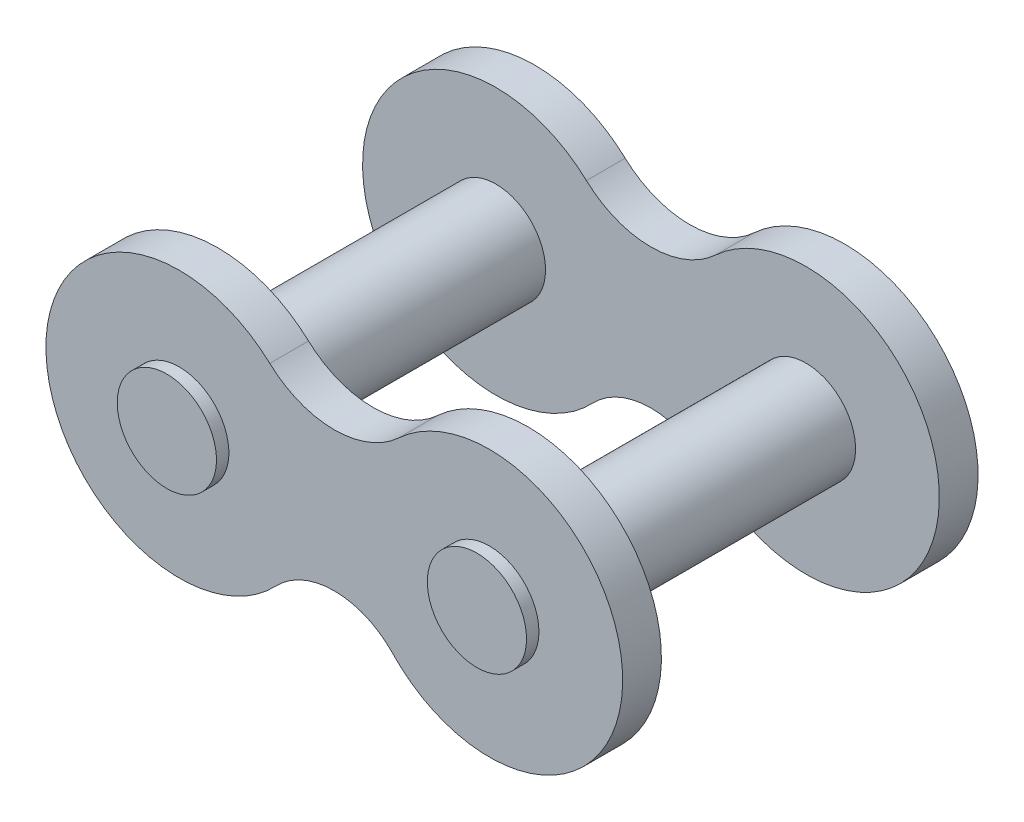
ISO-10303-21;
HEADER;
FILE_DESCRIPTION(('STEP AP214'),'2;1');
FILE_NAME('part.step','',(''),(''),'','','');
FILE_SCHEMA(('AUTOMOTIVE_DESIGN { 1 0 10303 214 1 1 1 1 }'));
ENDSEC;
DATA;
#1=APPLICATION_CONTEXT('core data for automotive mechanical design processes');
#2=APPLICATION_PROTOCOL_DEFINITION('international standard','automotive_design',2000,#1);
#3=PRODUCT_CONTEXT('',#1,'mechanical');
#4=PRODUCT('Part','Part','',(#3));
#5=PRODUCT_RELATED_PRODUCT_CATEGORY('part','',(#4));
#6=PRODUCT_DEFINITION_FORMATION('','',#4);
#7=PRODUCT_DEFINITION_CONTEXT('part definition',#1,'design');
#8=PRODUCT_DEFINITION('design','',#6,#7);
#9=PRODUCT_DEFINITION_SHAPE('','',#8);
#10=(LENGTH_UNIT() NAMED_UNIT(*) SI_UNIT(.MILLI.,.METRE.));
#11=(NAMED_UNIT(*) PLANE_ANGLE_UNIT() SI_UNIT($,.RADIAN.));
#12=(NAMED_UNIT(*) SI_UNIT($,.STERADIAN.) SOLID_ANGLE_UNIT());
#13=UNCERTAINTY_MEASURE_WITH_UNIT(LENGTH_MEASURE(1.E-05),#10,'distance_accuracy_value','');
#14=(GEOMETRIC_REPRESENTATION_CONTEXT(3) GLOBAL_UNCERTAINTY_ASSIGNED_CONTEXT((#13)) GLOBAL_UNIT_ASSIGNED_CONTEXT((#10,
#11,#12)) REPRESENTATION_CONTEXT('',''));
#15=CARTESIAN_POINT('',(0.,0.,0.));
#16=DIRECTION('',(0.,0.,1.));
#17=DIRECTION('',(1.,0.,0.));
#18=AXIS2_PLACEMENT_3D('',#15,#16,#17);
#19=CARTESIAN_POINT('',(3.175,3.4332241798094,1.5875));
#20=DIRECTION('',(0.,0.,1.));
#21=DIRECTION('',(1.,0.,0.));
#22=AXIS2_PLACEMENT_3D('',#19,#20,#21);
#23=PLANE('',#22);
#24=CARTESIAN_POINT('',(-6.35,0.,1.5875));
#25=DIRECTION('',(0.,0.,1.));
#26=DIRECTION('',(1.,0.,0.));
#27=AXIS2_PLACEMENT_3D('',#24,#25,#26);
#28=CIRCLE('',#27,2.032);
#29=CARTESIAN_POINT('',(-4.318,0.,1.5875));
#30=VERTEX_POINT('',#29);
#31=EDGE_CURVE('E169',#30,#30,#28,.T.);
#32=ORIENTED_EDGE('',*,*,#31,.F.);
#33=EDGE_LOOP('',(#32));
#34=FACE_BOUND('',#33,.T.);
#35=CARTESIAN_POINT('',(0.,6.86644835961881,1.5875));
#36=DIRECTION('',(0.,0.,-1.));
#37=DIRECTION('',(1.,0.,0.));
#38=AXIS2_PLACEMENT_3D('',#35,#36,#37);
#39=CIRCLE('',#38,3.89157253782679);
#40=CARTESIAN_POINT('',(2.64221266557984,4.00934334807003,1.5875));
#41=VERTEX_POINT('',#40);
#42=CARTESIAN_POINT('',(-2.64221266557984,4.00934334807003,1.5875));
#43=VERTEX_POINT('',#42);
#44=EDGE_CURVE('E173',#41,#43,#39,.T.);
#45=ORIENTED_EDGE('',*,*,#44,.T.);
#46=CARTESIAN_POINT('',(-6.35,0.,1.5875));
#47=DIRECTION('',(0.,0.,1.));
#48=DIRECTION('',(1.,0.,0.));
#49=AXIS2_PLACEMENT_3D('',#46,#47,#48);
#50=CIRCLE('',#49,5.461);
#51=CARTESIAN_POINT('',(-2.39260343674151,-3.76318129261798,1.5875));
#52=VERTEX_POINT('',#51);
#53=EDGE_CURVE('E86',#43,#52,#50,.T.);
#54=ORIENTED_EDGE('',*,*,#53,.T.);
#55=CARTESIAN_POINT('',(0.,-6.03836406742322,1.5875));
#56=DIRECTION('',(0.,0.,-1.));
#57=DIRECTION('',(-1.,0.,0.));
#58=AXIS2_PLACEMENT_3D('',#55,#56,#57);
#59=CIRCLE('',#58,3.30166743695936);
#60=CARTESIAN_POINT('',(2.39260343674152,-3.76318129261798,1.5875));
#61=VERTEX_POINT('',#60);
#62=EDGE_CURVE('E176',#52,#61,#59,.T.);
#63=ORIENTED_EDGE('',*,*,#62,.T.);
#64=CARTESIAN_POINT('',(6.35,0.,1.5875));
#65=DIRECTION('',(0.,0.,1.));
#66=DIRECTION('',(-1.,0.,0.));
#67=AXIS2_PLACEMENT_3D('',#64,#65,#66);
#68=CIRCLE('',#67,5.461);
#69=EDGE_CURVE('E54',#61,#41,#68,.T.);
#70=ORIENTED_EDGE('',*,*,#69,.T.);
#71=EDGE_LOOP('',(#45,#54,#63,#70));
#72=FACE_BOUND('',#71,.T.);
#73=CARTESIAN_POINT('',(6.35,0.,1.5875));
#74=DIRECTION('',(0.,0.,1.));
#75=DIRECTION('',(-1.,0.,0.));
#76=AXIS2_PLACEMENT_3D('',#73,#74,#75);
#77=CIRCLE('',#76,2.032);
#78=CARTESIAN_POINT('',(4.318,0.,1.5875));
#79=VERTEX_POINT('',#78);
#80=EDGE_CURVE('E166',#79,#79,#77,.T.);
#81=ORIENTED_EDGE('',*,*,#80,.F.);
#82=EDGE_LOOP('',(#81));
#83=FACE_BOUND('',#82,.T.);
#84=ADVANCED_FACE('F37',(#34,#72,#83),#23,.T.);
#85=CARTESIAN_POINT('',(3.175,3.4332241798094,0.));
#86=DIRECTION('',(0.,0.,1.));
#87=DIRECTION('',(1.,0.,0.));
#88=AXIS2_PLACEMENT_3D('',#85,#86,#87);
#89=PLANE('',#88);
#90=CARTESIAN_POINT('',(0.,6.86644835961881,0.));
#91=DIRECTION('',(0.,0.,-1.));
#92=DIRECTION('',(1.,0.,0.));
#93=AXIS2_PLACEMENT_3D('',#90,#91,#92);
#94=CIRCLE('',#93,3.89157253782679);
#95=CARTESIAN_POINT('',(2.64221266557984,4.00934334807003,0.));
#96=VERTEX_POINT('',#95);
#97=CARTESIAN_POINT('',(-2.64221266557984,4.00934334807003,0.));
#98=VERTEX_POINT('',#97);
#99=EDGE_CURVE('E172',#96,#98,#94,.T.);
#100=ORIENTED_EDGE('',*,*,#99,.F.);
#101=CARTESIAN_POINT('',(6.35,0.,0.));
#102=DIRECTION('',(0.,0.,1.));
#103=DIRECTION('',(-1.,0.,0.));
#104=AXIS2_PLACEMENT_3D('',#101,#102,#103);
#105=CIRCLE('',#104,5.461);
#106=CARTESIAN_POINT('',(2.39260343674152,-3.76318129261798,0.));
#107=VERTEX_POINT('',#106);
#108=EDGE_CURVE('E78',#107,#96,#105,.T.);
#109=ORIENTED_EDGE('',*,*,#108,.F.);
#110=CARTESIAN_POINT('',(0.,-6.03836406742322,0.));
#111=DIRECTION('',(0.,0.,-1.));
#112=DIRECTION('',(-1.,0.,0.));
#113=AXIS2_PLACEMENT_3D('',#110,#111,#112);
#114=CIRCLE('',#113,3.30166743695936);
#115=CARTESIAN_POINT('',(-2.39260343674151,-3.76318129261798,0.));
#116=VERTEX_POINT('',#115);
#117=EDGE_CURVE('E72',#116,#107,#114,.T.);
#118=ORIENTED_EDGE('',*,*,#117,.F.);
#119=CARTESIAN_POINT('',(-6.35,0.,0.));
#120=DIRECTION('',(0.,0.,1.));
#121=DIRECTION('',(1.,0.,0.));
#122=AXIS2_PLACEMENT_3D('',#119,#120,#121);
#123=CIRCLE('',#122,5.461);
#124=EDGE_CURVE('E182',#98,#116,#123,.T.);
#125=ORIENTED_EDGE('',*,*,#124,.F.);
#126=EDGE_LOOP('',(#100,#109,#118,#125));
#127=FACE_BOUND('',#126,.T.);
#128=CARTESIAN_POINT('',(-6.35,0.,0.));
#129=DIRECTION('',(0.,0.,1.));
#130=DIRECTION('',(1.,0.,0.));
#131=AXIS2_PLACEMENT_3D('',#128,#129,#130);
#132=CIRCLE('',#131,2.032);
#133=CARTESIAN_POINT('',(-4.318,0.,0.));
#134=VERTEX_POINT('',#133);
#135=EDGE_CURVE('E163',#134,#134,#132,.F.);
#136=ORIENTED_EDGE('',*,*,#135,.F.);
#137=EDGE_LOOP('',(#136));
#138=FACE_BOUND('',#137,.T.);
#139=CARTESIAN_POINT('',(6.35,0.,0.));
#140=DIRECTION('',(0.,0.,1.));
#141=DIRECTION('',(1.,0.,0.));
#142=AXIS2_PLACEMENT_3D('',#139,#140,#141);
#143=CIRCLE('',#142,2.032);
#144=CARTESIAN_POINT('',(8.382,0.,0.));
#145=VERTEX_POINT('',#144);
#146=EDGE_CURVE('E204',#145,#145,#143,.T.);
#147=ORIENTED_EDGE('',*,*,#146,.T.);
#148=EDGE_LOOP('',(#147));
#149=FACE_BOUND('',#148,.T.);
#150=ADVANCED_FACE('F196',(#127,#138,#149),#89,.F.);
#151=CARTESIAN_POINT('',(0.,6.86644835961881,1.5875));
#152=DIRECTION('',(0.,0.,-1.));
#153=DIRECTION('',(-1.,0.,0.));
#154=AXIS2_PLACEMENT_3D('',#151,#152,#153);
#155=CYLINDRICAL_SURFACE('',#154,3.89157253782679);
#156=ORIENTED_EDGE('',*,*,#99,.T.);
#157=DIRECTION('',(0.,0.,-1.));
#158=VECTOR('',#157,1.);
#159=CARTESIAN_POINT('',(-2.64221266557984,4.00934334807003,1.5875));
#160=LINE('',#159,#158);
#161=EDGE_CURVE('E46',#43,#98,#160,.T.);
#162=ORIENTED_EDGE('',*,*,#161,.F.);
#163=ORIENTED_EDGE('',*,*,#44,.F.);
#164=DIRECTION('',(0.,0.,-1.));
#165=VECTOR('',#164,1.);
#166=CARTESIAN_POINT('',(2.64221266557984,4.00934334807003,1.5875));
#167=LINE('',#166,#165);
#168=EDGE_CURVE('E179',#41,#96,#167,.T.);
#169=ORIENTED_EDGE('',*,*,#168,.T.);
#170=EDGE_LOOP('',(#156,#162,#163,#169));
#171=FACE_BOUND('',#170,.T.);
#172=ADVANCED_FACE('F39',(#171),#155,.F.);
#173=CARTESIAN_POINT('',(-6.35,0.,1.5875));
#174=DIRECTION('',(0.,0.,-1.));
#175=DIRECTION('',(-1.,0.,0.));
#176=AXIS2_PLACEMENT_3D('',#173,#174,#175);
#177=CYLINDRICAL_SURFACE('',#176,5.461);
#178=ORIENTED_EDGE('',*,*,#124,.T.);
#179=DIRECTION('',(0.,0.,-1.));
#180=VECTOR('',#179,1.);
#181=CARTESIAN_POINT('',(-2.39260343674151,-3.76318129261798,1.5875));
#182=LINE('',#181,#180);
#183=EDGE_CURVE('E189',#52,#116,#182,.T.);
#184=ORIENTED_EDGE('',*,*,#183,.F.);
#185=ORIENTED_EDGE('',*,*,#53,.F.);
#186=ORIENTED_EDGE('',*,*,#161,.T.);
#187=EDGE_LOOP('',(#178,#184,#185,#186));
#188=FACE_BOUND('',#187,.T.);
#189=ADVANCED_FACE('F191',(#188),#177,.T.);
#190=CARTESIAN_POINT('',(0.,-6.03836406742322,1.5875));
#191=DIRECTION('',(0.,0.,-1.));
#192=DIRECTION('',(-1.,0.,0.));
#193=AXIS2_PLACEMENT_3D('',#190,#191,#192);
#194=CYLINDRICAL_SURFACE('',#193,3.30166743695936);
#195=ORIENTED_EDGE('',*,*,#117,.T.);
#196=DIRECTION('',(0.,0.,-1.));
#197=VECTOR('',#196,1.);
#198=CARTESIAN_POINT('',(2.39260343674152,-3.76318129261798,1.5875));
#199=LINE('',#198,#197);
#200=EDGE_CURVE('E187',#61,#107,#199,.T.);
#201=ORIENTED_EDGE('',*,*,#200,.F.);
#202=ORIENTED_EDGE('',*,*,#62,.F.);
#203=ORIENTED_EDGE('',*,*,#183,.T.);
#204=EDGE_LOOP('',(#195,#201,#202,#203));
#205=FACE_BOUND('',#204,.T.);
#206=ADVANCED_FACE('F273',(#205),#194,.F.);
#207=CARTESIAN_POINT('',(6.35,0.,1.5875));
#208=DIRECTION('',(0.,0.,-1.));
#209=DIRECTION('',(-1.,0.,0.));
#210=AXIS2_PLACEMENT_3D('',#207,#208,#209);
#211=CYLINDRICAL_SURFACE('',#210,5.461);
#212=ORIENTED_EDGE('',*,*,#108,.T.);
#213=ORIENTED_EDGE('',*,*,#168,.F.);
#214=ORIENTED_EDGE('',*,*,#69,.F.);
#215=ORIENTED_EDGE('',*,*,#200,.T.);
#216=EDGE_LOOP('',(#212,#213,#214,#215));
#217=FACE_BOUND('',#216,.T.);
#218=ADVANCED_FACE('F268',(#217),#211,.T.);
#219=CARTESIAN_POINT('',(-6.35,0.,-0.508));
#220=DIRECTION('',(0.,0.,-1.));
#221=DIRECTION('',(-1.,0.,0.));
#222=AXIS2_PLACEMENT_3D('',#219,#220,#221);
#223=PLANE('',#222);
#224=CARTESIAN_POINT('',(-6.35,0.,-0.508));
#225=DIRECTION('',(0.,0.,-1.));
#226=DIRECTION('',(-1.,0.,0.));
#227=AXIS2_PLACEMENT_3D('',#224,#225,#226);
#228=CIRCLE('',#227,2.032);
#229=CARTESIAN_POINT('',(-8.382,0.,-0.508));
#230=VERTEX_POINT('',#229);
#231=EDGE_CURVE('E160',#230,#230,#228,.T.);
#232=ORIENTED_EDGE('',*,*,#231,.T.);
#233=EDGE_LOOP('',(#232));
#234=FACE_BOUND('',#233,.T.);
#235=ADVANCED_FACE('F266',(#234),#223,.T.);
#236=CARTESIAN_POINT('',(-6.35,0.,-0.508));
#237=DIRECTION('',(0.,0.,1.));
#238=DIRECTION('',(1.,0.,0.));
#239=AXIS2_PLACEMENT_3D('',#236,#237,#238);
#240=CYLINDRICAL_SURFACE('',#239,2.032);
#241=ORIENTED_EDGE('',*,*,#231,.F.);
#242=EDGE_LOOP('',(#241));
#243=FACE_BOUND('',#242,.T.);
#244=ORIENTED_EDGE('',*,*,#135,.T.);
#245=EDGE_LOOP('',(#244));
#246=FACE_BOUND('',#245,.T.);
#247=ADVANCED_FACE('F222',(#243,#246),#240,.T.);
#248=CARTESIAN_POINT('',(-6.35,0.,12.969748));
#249=DIRECTION('',(0.,0.,1.));
#250=DIRECTION('',(1.,0.,0.));
#251=AXIS2_PLACEMENT_3D('',#248,#249,#250);
#252=CIRCLE('',#251,2.032);
#253=CARTESIAN_POINT('',(-4.318,0.,12.969748));
#254=VERTEX_POINT('',#253);
#255=EDGE_CURVE('E147',#254,#254,#252,.T.);
#256=ORIENTED_EDGE('',*,*,#255,.F.);
#257=EDGE_LOOP('',(#256));
#258=FACE_BOUND('',#257,.T.);
#259=ORIENTED_EDGE('',*,*,#31,.T.);
#260=EDGE_LOOP('',(#259));
#261=FACE_BOUND('',#260,.T.);
#262=ADVANCED_FACE('F219',(#258,#261),#240,.T.);
#263=CARTESIAN_POINT('',(0.,6.86644835961881,12.969748));
#264=DIRECTION('',(0.,0.,1.));
#265=DIRECTION('',(1.,0.,0.));
#266=AXIS2_PLACEMENT_3D('',#263,#264,#265);
#267=CYLINDRICAL_SURFACE('',#266,3.89157253782679);
#268=CARTESIAN_POINT('',(0.,6.86644835961881,14.557248));
#269=DIRECTION('',(0.,0.,-1.));
#270=DIRECTION('',(1.,0.,0.));
#271=AXIS2_PLACEMENT_3D('',#268,#269,#270);
#272=CIRCLE('',#271,3.89157253782679);
#273=CARTESIAN_POINT('',(2.64221266557984,4.00934334807003,14.557248));
#274=VERTEX_POINT('',#273);
#275=CARTESIAN_POINT('',(-2.64221266557984,4.00934334807003,14.557248));
#276=VERTEX_POINT('',#275);
#277=EDGE_CURVE('E119',#274,#276,#272,.T.);
#278=ORIENTED_EDGE('',*,*,#277,.F.);
#279=DIRECTION('',(0.,0.,1.));
#280=VECTOR('',#279,1.);
#281=CARTESIAN_POINT('',(2.64221266557984,4.00934334807003,12.969748));
#282=LINE('',#281,#280);
#283=CARTESIAN_POINT('',(2.64221266557984,4.00934334807003,12.969748));
#284=VERTEX_POINT('',#283);
#285=EDGE_CURVE('E113',#284,#274,#282,.T.);
#286=ORIENTED_EDGE('',*,*,#285,.F.);
#287=CARTESIAN_POINT('',(0.,6.86644835961881,12.969748));
#288=DIRECTION('',(0.,0.,-1.));
#289=DIRECTION('',(1.,0.,0.));
#290=AXIS2_PLACEMENT_3D('',#287,#288,#289);
#291=CIRCLE('',#290,3.89157253782679);
#292=CARTESIAN_POINT('',(-2.64221266557984,4.00934334807003,12.969748));
#293=VERTEX_POINT('',#292);
#294=EDGE_CURVE('E116',#284,#293,#291,.T.);
#295=ORIENTED_EDGE('',*,*,#294,.T.);
#296=DIRECTION('',(0.,0.,1.));
#297=VECTOR('',#296,1.);
#298=CARTESIAN_POINT('',(-2.64221266557984,4.00934334807003,12.969748));
#299=LINE('',#298,#297);
#300=EDGE_CURVE('E144',#293,#276,#299,.T.);
#301=ORIENTED_EDGE('',*,*,#300,.T.);
#302=EDGE_LOOP('',(#278,#286,#295,#301));
#303=FACE_BOUND('',#302,.T.);
#304=ADVANCED_FACE('F115',(#303),#267,.F.);
#305=CARTESIAN_POINT('',(6.35,0.,12.969748));
#306=DIRECTION('',(0.,0.,1.));
#307=DIRECTION('',(1.,0.,0.));
#308=AXIS2_PLACEMENT_3D('',#305,#306,#307);
#309=CYLINDRICAL_SURFACE('',#308,5.461);
#310=CARTESIAN_POINT('',(6.35,0.,14.557248));
#311=DIRECTION('',(0.,0.,1.));
#312=DIRECTION('',(-1.,0.,0.));
#313=AXIS2_PLACEMENT_3D('',#310,#311,#312);
#314=CIRCLE('',#313,5.461);
#315=CARTESIAN_POINT('',(2.39260343674152,-3.76318129261798,14.557248));
#316=VERTEX_POINT('',#315);
#317=EDGE_CURVE('E146',#316,#274,#314,.T.);
#318=ORIENTED_EDGE('',*,*,#317,.F.);
#319=DIRECTION('',(0.,0.,1.));
#320=VECTOR('',#319,1.);
#321=CARTESIAN_POINT('',(2.39260343674152,-3.76318129261798,12.969748));
#322=LINE('',#321,#320);
#323=CARTESIAN_POINT('',(2.39260343674152,-3.76318129261798,12.969748));
#324=VERTEX_POINT('',#323);
#325=EDGE_CURVE('E125',#324,#316,#322,.T.);
#326=ORIENTED_EDGE('',*,*,#325,.F.);
#327=CARTESIAN_POINT('',(6.35,0.,12.969748));
#328=DIRECTION('',(0.,0.,1.));
#329=DIRECTION('',(-1.,0.,0.));
#330=AXIS2_PLACEMENT_3D('',#327,#328,#329);
#331=CIRCLE('',#330,5.461);
#332=EDGE_CURVE('E131',#324,#284,#331,.T.);
#333=ORIENTED_EDGE('',*,*,#332,.T.);
#334=ORIENTED_EDGE('',*,*,#285,.T.);
#335=EDGE_LOOP('',(#318,#326,#333,#334));
#336=FACE_BOUND('',#335,.T.);
#337=ADVANCED_FACE('F137',(#336),#309,.T.);
#338=CARTESIAN_POINT('',(0.,-6.03836406742322,12.969748));
#339=DIRECTION('',(0.,0.,1.));
#340=DIRECTION('',(1.,0.,0.));
#341=AXIS2_PLACEMENT_3D('',#338,#339,#340);
#342=CYLINDRICAL_SURFACE('',#341,3.30166743695936);
#343=CARTESIAN_POINT('',(0.,-6.03836406742322,14.557248));
#344=DIRECTION('',(0.,0.,-1.));
#345=DIRECTION('',(-1.,0.,0.));
#346=AXIS2_PLACEMENT_3D('',#343,#344,#345);
#347=CIRCLE('',#346,3.30166743695936);
#348=CARTESIAN_POINT('',(-2.39260343674151,-3.76318129261798,14.557248));
#349=VERTEX_POINT('',#348);
#350=EDGE_CURVE('E149',#349,#316,#347,.T.);
#351=ORIENTED_EDGE('',*,*,#350,.F.);
#352=DIRECTION('',(0.,0.,1.));
#353=VECTOR('',#352,1.);
#354=CARTESIAN_POINT('',(-2.39260343674151,-3.76318129261798,12.969748));
#355=LINE('',#354,#353);
#356=CARTESIAN_POINT('',(-2.39260343674151,-3.76318129261798,12.969748));
#357=VERTEX_POINT('',#356);
#358=EDGE_CURVE('E155',#357,#349,#355,.T.);
#359=ORIENTED_EDGE('',*,*,#358,.F.);
#360=CARTESIAN_POINT('',(0.,-6.03836406742322,12.969748));
#361=DIRECTION('',(0.,0.,-1.));
#362=DIRECTION('',(-1.,0.,0.));
#363=AXIS2_PLACEMENT_3D('',#360,#361,#362);
#364=CIRCLE('',#363,3.30166743695936);
#365=EDGE_CURVE('E138',#357,#324,#364,.T.);
#366=ORIENTED_EDGE('',*,*,#365,.T.);
#367=ORIENTED_EDGE('',*,*,#325,.T.);
#368=EDGE_LOOP('',(#351,#359,#366,#367));
#369=FACE_BOUND('',#368,.T.);
#370=ADVANCED_FACE('F251',(#369),#342,.F.);
#371=CARTESIAN_POINT('',(-6.35,0.,12.969748));
#372=DIRECTION('',(0.,0.,1.));
#373=DIRECTION('',(1.,0.,0.));
#374=AXIS2_PLACEMENT_3D('',#371,#372,#373);
#375=CYLINDRICAL_SURFACE('',#374,5.461);
#376=CARTESIAN_POINT('',(-6.35,0.,14.557248));
#377=DIRECTION('',(0.,0.,1.));
#378=DIRECTION('',(1.,0.,0.));
#379=AXIS2_PLACEMENT_3D('',#376,#377,#378);
#380=CIRCLE('',#379,5.461);
#381=EDGE_CURVE('E135',#276,#349,#380,.T.);
#382=ORIENTED_EDGE('',*,*,#381,.F.);
#383=ORIENTED_EDGE('',*,*,#300,.F.);
#384=CARTESIAN_POINT('',(-6.35,0.,12.969748));
#385=DIRECTION('',(0.,0.,1.));
#386=DIRECTION('',(1.,0.,0.));
#387=AXIS2_PLACEMENT_3D('',#384,#385,#386);
#388=CIRCLE('',#387,5.461);
#389=EDGE_CURVE('E134',#293,#357,#388,.T.);
#390=ORIENTED_EDGE('',*,*,#389,.T.);
#391=ORIENTED_EDGE('',*,*,#358,.T.);
#392=EDGE_LOOP('',(#382,#383,#390,#391));
#393=FACE_BOUND('',#392,.T.);
#394=ADVANCED_FACE('F242',(#393),#375,.T.);
#395=CARTESIAN_POINT('',(3.175,3.4332241798094,12.969748));
#396=DIRECTION('',(0.,0.,-1.));
#397=DIRECTION('',(1.,0.,0.));
#398=AXIS2_PLACEMENT_3D('',#395,#396,#397);
#399=PLANE('',#398);
#400=CARTESIAN_POINT('',(6.35,0.,12.969748));
#401=DIRECTION('',(0.,0.,-1.));
#402=DIRECTION('',(-1.,0.,0.));
#403=AXIS2_PLACEMENT_3D('',#400,#401,#402);
#404=CIRCLE('',#403,2.032);
#405=CARTESIAN_POINT('',(4.318,0.,12.969748));
#406=VERTEX_POINT('',#405);
#407=EDGE_CURVE('E207',#406,#406,#404,.T.);
#408=ORIENTED_EDGE('',*,*,#407,.F.);
#409=EDGE_LOOP('',(#408));
#410=FACE_BOUND('',#409,.T.);
#411=ORIENTED_EDGE('',*,*,#255,.T.);
#412=EDGE_LOOP('',(#411));
#413=FACE_BOUND('',#412,.T.);
#414=ORIENTED_EDGE('',*,*,#294,.F.);
#415=ORIENTED_EDGE('',*,*,#332,.F.);
#416=ORIENTED_EDGE('',*,*,#365,.F.);
#417=ORIENTED_EDGE('',*,*,#389,.F.);
#418=EDGE_LOOP('',(#414,#415,#416,#417));
#419=FACE_BOUND('',#418,.T.);
#420=ADVANCED_FACE('F129',(#410,#413,#419),#399,.T.);
#421=CARTESIAN_POINT('',(3.175,3.4332241798094,14.557248));
#422=DIRECTION('',(0.,0.,-1.));
#423=DIRECTION('',(1.,0.,0.));
#424=AXIS2_PLACEMENT_3D('',#421,#422,#423);
#425=PLANE('',#424);
#426=CARTESIAN_POINT('',(6.35,0.,14.557248));
#427=DIRECTION('',(0.,0.,1.));
#428=DIRECTION('',(-1.,0.,0.));
#429=AXIS2_PLACEMENT_3D('',#426,#427,#428);
#430=CIRCLE('',#429,2.032);
#431=CARTESIAN_POINT('',(4.318,0.,14.557248));
#432=VERTEX_POINT('',#431);
#433=EDGE_CURVE('E206',#432,#432,#430,.T.);
#434=ORIENTED_EDGE('',*,*,#433,.F.);
#435=EDGE_LOOP('',(#434));
#436=FACE_BOUND('',#435,.T.);
#437=CARTESIAN_POINT('',(-6.35,0.,14.557248));
#438=DIRECTION('',(0.,0.,-1.));
#439=DIRECTION('',(-1.,0.,0.));
#440=AXIS2_PLACEMENT_3D('',#437,#438,#439);
#441=CIRCLE('',#440,2.032);
#442=CARTESIAN_POINT('',(-8.382,0.,14.557248));
#443=VERTEX_POINT('',#442);
#444=EDGE_CURVE('E11',#443,#443,#441,.T.);
#445=ORIENTED_EDGE('',*,*,#444,.T.);
#446=EDGE_LOOP('',(#445));
#447=FACE_BOUND('',#446,.T.);
#448=ORIENTED_EDGE('',*,*,#277,.T.);
#449=ORIENTED_EDGE('',*,*,#381,.T.);
#450=ORIENTED_EDGE('',*,*,#350,.T.);
#451=ORIENTED_EDGE('',*,*,#317,.T.);
#452=EDGE_LOOP('',(#448,#449,#450,#451));
#453=FACE_BOUND('',#452,.T.);
#454=ADVANCED_FACE('F241',(#436,#447,#453),#425,.F.);
#455=CARTESIAN_POINT('',(-6.35,0.,15.065248));
#456=DIRECTION('',(0.,0.,-1.));
#457=DIRECTION('',(-1.,0.,0.));
#458=AXIS2_PLACEMENT_3D('',#455,#456,#457);
#459=PLANE('',#458);
#460=CARTESIAN_POINT('',(-6.35,0.,15.065248));
#461=DIRECTION('',(0.,0.,-1.));
#462=DIRECTION('',(-1.,0.,0.));
#463=AXIS2_PLACEMENT_3D('',#460,#461,#462);
#464=CIRCLE('',#463,2.032);
#465=CARTESIAN_POINT('',(-8.382,0.,15.065248));
#466=VERTEX_POINT('',#465);
#467=EDGE_CURVE('E124',#466,#466,#464,.T.);
#468=ORIENTED_EDGE('',*,*,#467,.F.);
#469=EDGE_LOOP('',(#468));
#470=FACE_BOUND('',#469,.T.);
#471=ADVANCED_FACE('F248',(#470),#459,.F.);
#472=ORIENTED_EDGE('',*,*,#467,.T.);
#473=EDGE_LOOP('',(#472));
#474=FACE_BOUND('',#473,.T.);
#475=ORIENTED_EDGE('',*,*,#444,.F.);
#476=EDGE_LOOP('',(#475));
#477=FACE_BOUND('',#476,.T.);
#478=ADVANCED_FACE('F224',(#474,#477),#240,.T.);
#479=CARTESIAN_POINT('',(6.35,0.,15.065248));
#480=DIRECTION('',(0.,0.,-1.));
#481=DIRECTION('',(1.,0.,0.));
#482=AXIS2_PLACEMENT_3D('',#479,#480,#481);
#483=PLANE('',#482);
#484=CARTESIAN_POINT('',(6.35,0.,15.065248));
#485=DIRECTION('',(0.,0.,1.));
#486=DIRECTION('',(1.,0.,0.));
#487=AXIS2_PLACEMENT_3D('',#484,#485,#486);
#488=CIRCLE('',#487,2.032);
#489=CARTESIAN_POINT('',(8.382,0.,15.065248));
#490=VERTEX_POINT('',#489);
#491=EDGE_CURVE('E415',#490,#490,#488,.T.);
#492=ORIENTED_EDGE('',*,*,#491,.T.);
#493=EDGE_LOOP('',(#492));
#494=FACE_BOUND('',#493,.T.);
#495=ADVANCED_FACE('F340',(#494),#483,.F.);
#496=CARTESIAN_POINT('',(6.35,0.,-0.508));
#497=DIRECTION('',(0.,0.,1.));
#498=DIRECTION('',(1.,0.,0.));
#499=AXIS2_PLACEMENT_3D('',#496,#497,#498);
#500=CYLINDRICAL_SURFACE('',#499,2.032);
#501=ORIENTED_EDGE('',*,*,#491,.F.);
#502=EDGE_LOOP('',(#501));
#503=FACE_BOUND('',#502,.T.);
#504=ORIENTED_EDGE('',*,*,#433,.T.);
#505=EDGE_LOOP('',(#504));
#506=FACE_BOUND('',#505,.T.);
#507=ADVANCED_FACE('F236',(#503,#506),#500,.T.);
#508=ORIENTED_EDGE('',*,*,#80,.T.);
#509=EDGE_LOOP('',(#508));
#510=FACE_BOUND('',#509,.T.);
#511=ORIENTED_EDGE('',*,*,#407,.T.);
#512=EDGE_LOOP('',(#511));
#513=FACE_BOUND('',#512,.T.);
#514=ADVANCED_FACE('F232',(#510,#513),#500,.T.);
#515=CARTESIAN_POINT('',(6.35,0.,-0.508));
#516=DIRECTION('',(0.,0.,1.));
#517=DIRECTION('',(1.,0.,0.));
#518=AXIS2_PLACEMENT_3D('',#515,#516,#517);
#519=CIRCLE('',#518,2.032);
#520=CARTESIAN_POINT('',(8.382,0.,-0.508));
#521=VERTEX_POINT('',#520);
#522=EDGE_CURVE('E212',#521,#521,#519,.T.);
#523=ORIENTED_EDGE('',*,*,#522,.T.);
#524=EDGE_LOOP('',(#523));
#525=FACE_BOUND('',#524,.T.);
#526=ORIENTED_EDGE('',*,*,#146,.F.);
#527=EDGE_LOOP('',(#526));
#528=FACE_BOUND('',#527,.T.);
#529=ADVANCED_FACE('F235',(#525,#528),#500,.T.);
#530=CARTESIAN_POINT('',(6.35,0.,-0.508));
#531=DIRECTION('',(0.,0.,-1.));
#532=DIRECTION('',(1.,0.,0.));
#533=AXIS2_PLACEMENT_3D('',#530,#531,#532);
#534=PLANE('',#533);
#535=ORIENTED_EDGE('',*,*,#522,.F.);
#536=EDGE_LOOP('',(#535));
#537=FACE_BOUND('',#536,.T.);
#538=ADVANCED_FACE('F396',(#537),#534,.T.);
#539=CLOSED_SHELL('',(#84,#150,#172,#189,#206,#218,#235,#247,#262,#304,#337,#370,#394,#420,#454,
#471,#478,#495,#507,#514,#529,#538));
#540=MANIFOLD_SOLID_BREP('B2',#539);
#541=ADVANCED_BREP_SHAPE_REPRESENTATION('',(#18,#540),#14);
#542=SHAPE_DEFINITION_REPRESENTATION(#9,#541);
ENDSEC;
END-ISO-10303-21;
